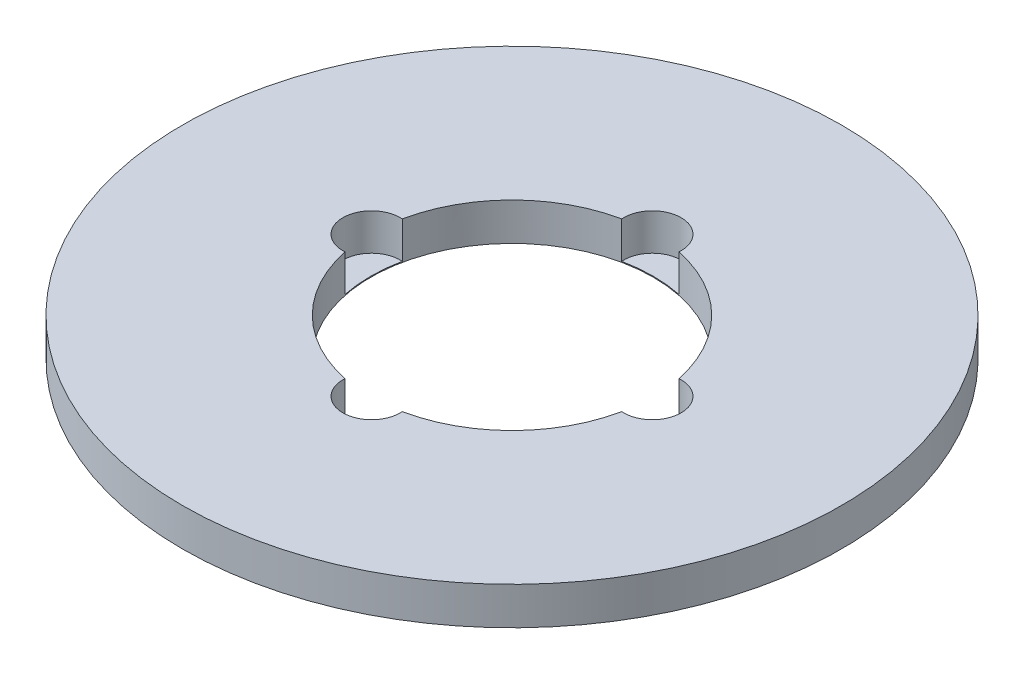
ISO-10303-21;
HEADER;
FILE_DESCRIPTION(('STEP AP214'),'2;1');
FILE_NAME('part.step','',(''),(''),'','','');
FILE_SCHEMA(('AUTOMOTIVE_DESIGN { 1 0 10303 214 1 1 1 1 }'));
ENDSEC;
DATA;
#1=APPLICATION_CONTEXT('core data for automotive mechanical design processes');
#2=APPLICATION_PROTOCOL_DEFINITION('international standard','automotive_design',2000,#1);
#3=PRODUCT_CONTEXT('',#1,'mechanical');
#4=PRODUCT('Part','Part','',(#3));
#5=PRODUCT_RELATED_PRODUCT_CATEGORY('part','',(#4));
#6=PRODUCT_DEFINITION_FORMATION('','',#4);
#7=PRODUCT_DEFINITION_CONTEXT('part definition',#1,'design');
#8=PRODUCT_DEFINITION('design','',#6,#7);
#9=PRODUCT_DEFINITION_SHAPE('','',#8);
#10=(LENGTH_UNIT() NAMED_UNIT(*) SI_UNIT(.MILLI.,.METRE.));
#11=(NAMED_UNIT(*) PLANE_ANGLE_UNIT() SI_UNIT($,.RADIAN.));
#12=(NAMED_UNIT(*) SI_UNIT($,.STERADIAN.) SOLID_ANGLE_UNIT());
#13=UNCERTAINTY_MEASURE_WITH_UNIT(LENGTH_MEASURE(1.E-05),#10,'distance_accuracy_value','');
#14=(GEOMETRIC_REPRESENTATION_CONTEXT(3) GLOBAL_UNCERTAINTY_ASSIGNED_CONTEXT((#13)) GLOBAL_UNIT_ASSIGNED_CONTEXT((#10,
#11,#12)) REPRESENTATION_CONTEXT('',''));
#15=CARTESIAN_POINT('',(0.,0.,0.));
#16=DIRECTION('',(0.,0.,1.));
#17=DIRECTION('',(1.,0.,0.));
#18=AXIS2_PLACEMENT_3D('',#15,#16,#17);
#19=CARTESIAN_POINT('',(0.,4.,0.));
#20=DIRECTION('',(0.,-1.,0.));
#21=DIRECTION('',(0.,0.,-1.));
#22=AXIS2_PLACEMENT_3D('',#19,#20,#21);
#23=CYLINDRICAL_SURFACE('',#22,35.);
#24=CARTESIAN_POINT('',(0.,4.,0.));
#25=DIRECTION('',(0.,1.,0.));
#26=DIRECTION('',(0.,0.,1.));
#27=AXIS2_PLACEMENT_3D('',#24,#25,#26);
#28=CIRCLE('',#27,35.);
#29=CARTESIAN_POINT('',(0.,4.,35.));
#30=VERTEX_POINT('',#29);
#31=EDGE_CURVE('E145',#30,#30,#28,.T.);
#32=ORIENTED_EDGE('',*,*,#31,.F.);
#33=EDGE_LOOP('',(#32));
#34=FACE_BOUND('',#33,.T.);
#35=CARTESIAN_POINT('',(0.,0.,0.));
#36=DIRECTION('',(0.,1.,0.));
#37=DIRECTION('',(0.,0.,1.));
#38=AXIS2_PLACEMENT_3D('',#35,#36,#37);
#39=CIRCLE('',#38,35.);
#40=CARTESIAN_POINT('',(0.,0.,35.));
#41=VERTEX_POINT('',#40);
#42=EDGE_CURVE('E143',#41,#41,#39,.T.);
#43=ORIENTED_EDGE('',*,*,#42,.T.);
#44=EDGE_LOOP('',(#43));
#45=FACE_BOUND('',#44,.T.);
#46=ADVANCED_FACE('F39',(#34,#45),#23,.T.);
#47=CARTESIAN_POINT('',(0.,4.,0.));
#48=DIRECTION('',(0.,1.,0.));
#49=DIRECTION('',(0.,0.,1.));
#50=AXIS2_PLACEMENT_3D('',#47,#48,#49);
#51=PLANE('',#50);
#52=CARTESIAN_POINT('',(0.,4.,14.9126513847627));
#53=DIRECTION('',(0.,1.,0.));
#54=DIRECTION('',(1.,0.,0.));
#55=AXIS2_PLACEMENT_3D('',#52,#53,#54);
#56=CIRCLE('',#55,3.0462327956706);
#57=CARTESIAN_POINT('',(-3.03802086041827,4.,14.6891262249211));
#58=VERTEX_POINT('',#57);
#59=CARTESIAN_POINT('',(3.03802086041837,4.,14.689126224921));
#60=VERTEX_POINT('',#59);
#61=EDGE_CURVE('E152',#58,#60,#56,.T.);
#62=ORIENTED_EDGE('',*,*,#61,.F.);
#63=CARTESIAN_POINT('',(0.,4.,0.));
#64=DIRECTION('',(0.,1.,0.));
#65=DIRECTION('',(0.,0.,1.));
#66=AXIS2_PLACEMENT_3D('',#63,#64,#65);
#67=CIRCLE('',#66,15.);
#68=CARTESIAN_POINT('',(-14.689126224921,4.,3.03802086041832));
#69=VERTEX_POINT('',#68);
#70=EDGE_CURVE('E133',#69,#58,#67,.T.);
#71=ORIENTED_EDGE('',*,*,#70,.F.);
#72=CARTESIAN_POINT('',(-14.9126513847627,4.,0.));
#73=DIRECTION('',(0.,1.,0.));
#74=DIRECTION('',(0.,0.,1.));
#75=AXIS2_PLACEMENT_3D('',#72,#73,#74);
#76=CIRCLE('',#75,3.0462327956706);
#77=CARTESIAN_POINT('',(-14.689126224921,4.,-3.03802086041832));
#78=VERTEX_POINT('',#77);
#79=EDGE_CURVE('E128',#78,#69,#76,.T.);
#80=ORIENTED_EDGE('',*,*,#79,.F.);
#81=CARTESIAN_POINT('',(-3.03802086041848,4.,-14.689126224921));
#82=VERTEX_POINT('',#81);
#83=EDGE_CURVE('E121',#82,#78,#67,.T.);
#84=ORIENTED_EDGE('',*,*,#83,.F.);
#85=CARTESIAN_POINT('',(-1.56201732067717E-13,4.,-14.9126513847627));
#86=DIRECTION('',(0.,1.,0.));
#87=DIRECTION('',(-1.,0.,0.));
#88=AXIS2_PLACEMENT_3D('',#85,#86,#87);
#89=CIRCLE('',#88,3.0462327956706);
#90=CARTESIAN_POINT('',(3.03802086041817,4.,-14.6891262249211));
#91=VERTEX_POINT('',#90);
#92=EDGE_CURVE('E105',#91,#82,#89,.T.);
#93=ORIENTED_EDGE('',*,*,#92,.F.);
#94=CARTESIAN_POINT('',(14.689126224921,4.,-3.03802086041832));
#95=VERTEX_POINT('',#94);
#96=EDGE_CURVE('E131',#95,#91,#67,.T.);
#97=ORIENTED_EDGE('',*,*,#96,.F.);
#98=CARTESIAN_POINT('',(14.9126513847627,4.,0.));
#99=DIRECTION('',(0.,1.,0.));
#100=DIRECTION('',(0.,0.,-1.));
#101=AXIS2_PLACEMENT_3D('',#98,#99,#100);
#102=CIRCLE('',#101,3.0462327956706);
#103=CARTESIAN_POINT('',(14.689126224921,4.,3.03802086041832));
#104=VERTEX_POINT('',#103);
#105=EDGE_CURVE('E154',#104,#95,#102,.T.);
#106=ORIENTED_EDGE('',*,*,#105,.F.);
#107=EDGE_CURVE('E134',#60,#104,#67,.T.);
#108=ORIENTED_EDGE('',*,*,#107,.F.);
#109=EDGE_LOOP('',(#62,#71,#80,#84,#93,#97,#106,#108));
#110=FACE_BOUND('',#109,.T.);
#111=ORIENTED_EDGE('',*,*,#31,.T.);
#112=EDGE_LOOP('',(#111));
#113=FACE_BOUND('',#112,.T.);
#114=ADVANCED_FACE('F130',(#110,#113),#51,.T.);
#115=CARTESIAN_POINT('',(0.,0.,0.));
#116=DIRECTION('',(0.,1.,0.));
#117=DIRECTION('',(0.,0.,1.));
#118=AXIS2_PLACEMENT_3D('',#115,#116,#117);
#119=PLANE('',#118);
#120=CARTESIAN_POINT('',(0.,0.,0.));
#121=DIRECTION('',(0.,1.,0.));
#122=DIRECTION('',(0.,0.,1.));
#123=AXIS2_PLACEMENT_3D('',#120,#121,#122);
#124=CIRCLE('',#123,15.);
#125=CARTESIAN_POINT('',(0.,0.,15.));
#126=VERTEX_POINT('',#125);
#127=EDGE_CURVE('E135',#126,#126,#124,.T.);
#128=ORIENTED_EDGE('',*,*,#127,.T.);
#129=EDGE_LOOP('',(#128));
#130=FACE_BOUND('',#129,.T.);
#131=ORIENTED_EDGE('',*,*,#42,.F.);
#132=EDGE_LOOP('',(#131));
#133=FACE_BOUND('',#132,.T.);
#134=ADVANCED_FACE('F195',(#130,#133),#119,.F.);
#135=CARTESIAN_POINT('',(0.,4.,0.));
#136=DIRECTION('',(0.,-1.,0.));
#137=DIRECTION('',(0.,0.,-1.));
#138=AXIS2_PLACEMENT_3D('',#135,#136,#137);
#139=CYLINDRICAL_SURFACE('',#138,15.);
#140=DIRECTION('',(0.,1.,0.));
#141=VECTOR('',#140,1.);
#142=CARTESIAN_POINT('',(-3.03802086041827,2.04798829433904,14.6891262249211));
#143=LINE('',#142,#141);
#144=CARTESIAN_POINT('',(-3.03802086041827,0.0959765886780753,14.6891262249211));
#145=VERTEX_POINT('',#144);
#146=EDGE_CURVE('E11',#145,#58,#143,.T.);
#147=ORIENTED_EDGE('',*,*,#146,.F.);
#148=CARTESIAN_POINT('',(0.,0.0959765886780753,0.));
#149=DIRECTION('',(0.,1.,0.));
#150=DIRECTION('',(0.,0.,1.));
#151=AXIS2_PLACEMENT_3D('',#148,#149,#150);
#152=CIRCLE('',#151,15.);
#153=CARTESIAN_POINT('',(3.03802086041837,0.0959765886780753,14.689126224921));
#154=VERTEX_POINT('',#153);
#155=EDGE_CURVE('E169',#145,#154,#152,.T.);
#156=ORIENTED_EDGE('',*,*,#155,.T.);
#157=DIRECTION('',(0.,1.,0.));
#158=VECTOR('',#157,1.);
#159=CARTESIAN_POINT('',(3.03802086041837,2.04798829433904,14.689126224921));
#160=LINE('',#159,#158);
#161=EDGE_CURVE('E46',#60,#154,#160,.F.);
#162=ORIENTED_EDGE('',*,*,#161,.F.);
#163=ORIENTED_EDGE('',*,*,#107,.T.);
#164=DIRECTION('',(0.,1.,0.));
#165=VECTOR('',#164,1.);
#166=CARTESIAN_POINT('',(14.689126224921,2.04798829433904,3.03802086041832));
#167=LINE('',#166,#165);
#168=CARTESIAN_POINT('',(14.689126224921,0.0959765886780753,3.03802086041832));
#169=VERTEX_POINT('',#168);
#170=EDGE_CURVE('E151',#169,#104,#167,.T.);
#171=ORIENTED_EDGE('',*,*,#170,.F.);
#172=CARTESIAN_POINT('',(0.,0.0959765886780753,0.));
#173=DIRECTION('',(0.,1.,0.));
#174=DIRECTION('',(0.,0.,1.));
#175=AXIS2_PLACEMENT_3D('',#172,#173,#174);
#176=CIRCLE('',#175,15.);
#177=CARTESIAN_POINT('',(14.689126224921,0.0959765886780753,-3.03802086041832));
#178=VERTEX_POINT('',#177);
#179=EDGE_CURVE('E173',#169,#178,#176,.T.);
#180=ORIENTED_EDGE('',*,*,#179,.T.);
#181=DIRECTION('',(0.,1.,0.));
#182=VECTOR('',#181,1.);
#183=CARTESIAN_POINT('',(14.689126224921,2.04798829433904,-3.03802086041832));
#184=LINE('',#183,#182);
#185=EDGE_CURVE('E168',#95,#178,#184,.F.);
#186=ORIENTED_EDGE('',*,*,#185,.F.);
#187=ORIENTED_EDGE('',*,*,#96,.T.);
#188=DIRECTION('',(0.,1.,0.));
#189=VECTOR('',#188,1.);
#190=CARTESIAN_POINT('',(3.03802086041817,2.04798829433904,-14.6891262249211));
#191=LINE('',#190,#189);
#192=CARTESIAN_POINT('',(3.03802086041817,0.0959765886780753,-14.6891262249211));
#193=VERTEX_POINT('',#192);
#194=EDGE_CURVE('E108',#193,#91,#191,.T.);
#195=ORIENTED_EDGE('',*,*,#194,.F.);
#196=CARTESIAN_POINT('',(0.,0.0959765886780753,0.));
#197=DIRECTION('',(0.,1.,0.));
#198=DIRECTION('',(0.,0.,1.));
#199=AXIS2_PLACEMENT_3D('',#196,#197,#198);
#200=CIRCLE('',#199,15.);
#201=CARTESIAN_POINT('',(-3.03802086041848,0.0959765886780753,-14.689126224921));
#202=VERTEX_POINT('',#201);
#203=EDGE_CURVE('E122',#193,#202,#200,.T.);
#204=ORIENTED_EDGE('',*,*,#203,.T.);
#205=DIRECTION('',(0.,1.,0.));
#206=VECTOR('',#205,1.);
#207=CARTESIAN_POINT('',(-3.03802086041848,2.04798829433904,-14.689126224921));
#208=LINE('',#207,#206);
#209=EDGE_CURVE('E106',#82,#202,#208,.F.);
#210=ORIENTED_EDGE('',*,*,#209,.F.);
#211=ORIENTED_EDGE('',*,*,#83,.T.);
#212=DIRECTION('',(0.,1.,0.));
#213=VECTOR('',#212,1.);
#214=CARTESIAN_POINT('',(-14.689126224921,2.04798829433904,-3.03802086041832));
#215=LINE('',#214,#213);
#216=CARTESIAN_POINT('',(-14.689126224921,0.0959765886780753,-3.03802086041832));
#217=VERTEX_POINT('',#216);
#218=EDGE_CURVE('E177',#217,#78,#215,.T.);
#219=ORIENTED_EDGE('',*,*,#218,.F.);
#220=CARTESIAN_POINT('',(0.,0.0959765886780753,0.));
#221=DIRECTION('',(0.,1.,0.));
#222=DIRECTION('',(0.,0.,1.));
#223=AXIS2_PLACEMENT_3D('',#220,#221,#222);
#224=CIRCLE('',#223,15.);
#225=CARTESIAN_POINT('',(-14.689126224921,0.0959765886780753,3.03802086041832));
#226=VERTEX_POINT('',#225);
#227=EDGE_CURVE('E185',#217,#226,#224,.T.);
#228=ORIENTED_EDGE('',*,*,#227,.T.);
#229=DIRECTION('',(0.,1.,0.));
#230=VECTOR('',#229,1.);
#231=CARTESIAN_POINT('',(-14.689126224921,2.04798829433904,3.03802086041832));
#232=LINE('',#231,#230);
#233=EDGE_CURVE('E179',#69,#226,#232,.F.);
#234=ORIENTED_EDGE('',*,*,#233,.F.);
#235=ORIENTED_EDGE('',*,*,#70,.T.);
#236=EDGE_LOOP('',(#147,#156,#162,#163,#171,#180,#186,#187,#195,#204,#210,#211,#219,#228,#234,#235));
#237=FACE_BOUND('',#236,.T.);
#238=ORIENTED_EDGE('',*,*,#127,.F.);
#239=EDGE_LOOP('',(#238));
#240=FACE_BOUND('',#239,.T.);
#241=ADVANCED_FACE('F117',(#237,#240),#139,.F.);
#242=CARTESIAN_POINT('',(-14.9126513847627,0.0959765886780753,0.));
#243=DIRECTION('',(0.,1.,0.));
#244=DIRECTION('',(0.,0.,1.));
#245=AXIS2_PLACEMENT_3D('',#242,#243,#244);
#246=CYLINDRICAL_SURFACE('',#245,3.0462327956706);
#247=ORIENTED_EDGE('',*,*,#218,.T.);
#248=ORIENTED_EDGE('',*,*,#79,.T.);
#249=ORIENTED_EDGE('',*,*,#233,.T.);
#250=CARTESIAN_POINT('',(-14.9126513847627,0.0959765886780753,0.));
#251=DIRECTION('',(0.,1.,0.));
#252=DIRECTION('',(0.,0.,1.));
#253=AXIS2_PLACEMENT_3D('',#250,#251,#252);
#254=CIRCLE('',#253,3.0462327956706);
#255=EDGE_CURVE('E140',#217,#226,#254,.T.);
#256=ORIENTED_EDGE('',*,*,#255,.F.);
#257=EDGE_LOOP('',(#247,#248,#249,#256));
#258=FACE_BOUND('',#257,.T.);
#259=ADVANCED_FACE('F200',(#258),#246,.F.);
#260=CARTESIAN_POINT('',(-14.9126513847627,0.0959765886780753,0.));
#261=DIRECTION('',(0.,1.,0.));
#262=DIRECTION('',(0.,0.,1.));
#263=AXIS2_PLACEMENT_3D('',#260,#261,#262);
#264=PLANE('',#263);
#265=ORIENTED_EDGE('',*,*,#255,.T.);
#266=ORIENTED_EDGE('',*,*,#227,.F.);
#267=EDGE_LOOP('',(#265,#266));
#268=FACE_BOUND('',#267,.T.);
#269=ADVANCED_FACE('F202',(#268),#264,.T.);
#270=CARTESIAN_POINT('',(-1.56201732067717E-13,0.0959765886780753,-14.9126513847627));
#271=DIRECTION('',(0.,1.,0.));
#272=DIRECTION('',(0.,0.,1.));
#273=AXIS2_PLACEMENT_3D('',#270,#271,#272);
#274=CYLINDRICAL_SURFACE('',#273,3.0462327956706);
#275=ORIENTED_EDGE('',*,*,#194,.T.);
#276=ORIENTED_EDGE('',*,*,#92,.T.);
#277=ORIENTED_EDGE('',*,*,#209,.T.);
#278=CARTESIAN_POINT('',(-1.56201732067717E-13,0.0959765886780753,-14.9126513847627));
#279=DIRECTION('',(0.,1.,0.));
#280=DIRECTION('',(-1.,0.,0.));
#281=AXIS2_PLACEMENT_3D('',#278,#279,#280);
#282=CIRCLE('',#281,3.0462327956706);
#283=EDGE_CURVE('E111',#193,#202,#282,.T.);
#284=ORIENTED_EDGE('',*,*,#283,.F.);
#285=EDGE_LOOP('',(#275,#276,#277,#284));
#286=FACE_BOUND('',#285,.T.);
#287=ADVANCED_FACE('F102',(#286),#274,.F.);
#288=CARTESIAN_POINT('',(-1.56201732067717E-13,0.0959765886780753,-14.9126513847627));
#289=DIRECTION('',(0.,1.,0.));
#290=DIRECTION('',(-1.,0.,0.));
#291=AXIS2_PLACEMENT_3D('',#288,#289,#290);
#292=PLANE('',#291);
#293=ORIENTED_EDGE('',*,*,#283,.T.);
#294=ORIENTED_EDGE('',*,*,#203,.F.);
#295=EDGE_LOOP('',(#293,#294));
#296=FACE_BOUND('',#295,.T.);
#297=ADVANCED_FACE('F211',(#296),#292,.T.);
#298=CARTESIAN_POINT('',(14.9126513847627,0.0959765886780753,0.));
#299=DIRECTION('',(0.,1.,0.));
#300=DIRECTION('',(0.,0.,1.));
#301=AXIS2_PLACEMENT_3D('',#298,#299,#300);
#302=CYLINDRICAL_SURFACE('',#301,3.0462327956706);
#303=ORIENTED_EDGE('',*,*,#170,.T.);
#304=ORIENTED_EDGE('',*,*,#105,.T.);
#305=ORIENTED_EDGE('',*,*,#185,.T.);
#306=CARTESIAN_POINT('',(14.9126513847627,0.0959765886780753,0.));
#307=DIRECTION('',(0.,1.,0.));
#308=DIRECTION('',(0.,0.,-1.));
#309=AXIS2_PLACEMENT_3D('',#306,#307,#308);
#310=CIRCLE('',#309,3.0462327956706);
#311=EDGE_CURVE('E56',#169,#178,#310,.T.);
#312=ORIENTED_EDGE('',*,*,#311,.F.);
#313=EDGE_LOOP('',(#303,#304,#305,#312));
#314=FACE_BOUND('',#313,.T.);
#315=ADVANCED_FACE('F212',(#314),#302,.F.);
#316=CARTESIAN_POINT('',(14.9126513847627,0.0959765886780753,0.));
#317=DIRECTION('',(0.,1.,0.));
#318=DIRECTION('',(0.,0.,-1.));
#319=AXIS2_PLACEMENT_3D('',#316,#317,#318);
#320=PLANE('',#319);
#321=ORIENTED_EDGE('',*,*,#311,.T.);
#322=ORIENTED_EDGE('',*,*,#179,.F.);
#323=EDGE_LOOP('',(#321,#322));
#324=FACE_BOUND('',#323,.T.);
#325=ADVANCED_FACE('F217',(#324),#320,.T.);
#326=CARTESIAN_POINT('',(0.,0.0959765886780753,14.9126513847627));
#327=DIRECTION('',(0.,1.,0.));
#328=DIRECTION('',(0.,0.,1.));
#329=AXIS2_PLACEMENT_3D('',#326,#327,#328);
#330=CYLINDRICAL_SURFACE('',#329,3.0462327956706);
#331=ORIENTED_EDGE('',*,*,#146,.T.);
#332=ORIENTED_EDGE('',*,*,#61,.T.);
#333=ORIENTED_EDGE('',*,*,#161,.T.);
#334=CARTESIAN_POINT('',(0.,0.0959765886780753,14.9126513847627));
#335=DIRECTION('',(0.,1.,0.));
#336=DIRECTION('',(1.,0.,0.));
#337=AXIS2_PLACEMENT_3D('',#334,#335,#336);
#338=CIRCLE('',#337,3.0462327956706);
#339=EDGE_CURVE('E55',#145,#154,#338,.T.);
#340=ORIENTED_EDGE('',*,*,#339,.F.);
#341=EDGE_LOOP('',(#331,#332,#333,#340));
#342=FACE_BOUND('',#341,.T.);
#343=ADVANCED_FACE('F170',(#342),#330,.F.);
#344=CARTESIAN_POINT('',(0.,0.0959765886780753,14.9126513847627));
#345=DIRECTION('',(0.,1.,0.));
#346=DIRECTION('',(1.,0.,0.));
#347=AXIS2_PLACEMENT_3D('',#344,#345,#346);
#348=PLANE('',#347);
#349=ORIENTED_EDGE('',*,*,#339,.T.);
#350=ORIENTED_EDGE('',*,*,#155,.F.);
#351=EDGE_LOOP('',(#349,#350));
#352=FACE_BOUND('',#351,.T.);
#353=ADVANCED_FACE('F224',(#352),#348,.T.);
#354=CLOSED_SHELL('',(#46,#114,#134,#241,#259,#269,#287,#297,#315,#325,#343,#353));
#355=MANIFOLD_SOLID_BREP('B2',#354);
#356=ADVANCED_BREP_SHAPE_REPRESENTATION('',(#18,#355),#14);
#357=SHAPE_DEFINITION_REPRESENTATION(#9,#356);
ENDSEC;
END-ISO-10303-21;
